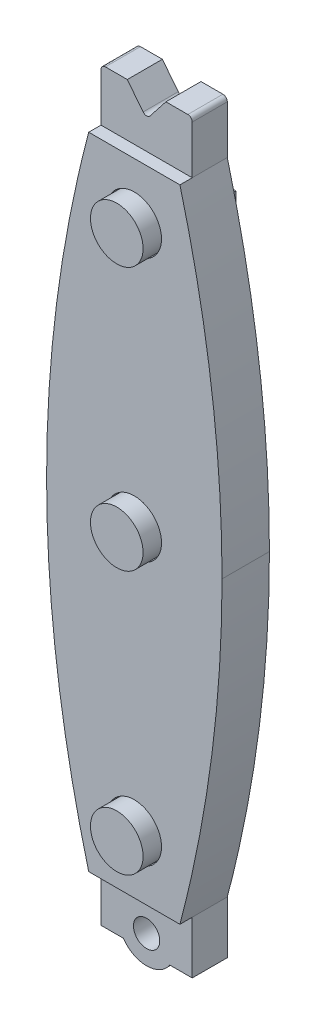
ISO-10303-21;
HEADER;
FILE_DESCRIPTION(('STEP AP214'),'2;1');
FILE_NAME('part.step','',(''),(''),'','','');
FILE_SCHEMA(('AUTOMOTIVE_DESIGN { 1 0 10303 214 1 1 1 1 }'));
ENDSEC;
DATA;
#1=APPLICATION_CONTEXT('core data for automotive mechanical design processes');
#2=APPLICATION_PROTOCOL_DEFINITION('international standard','automotive_design',2000,#1);
#3=PRODUCT_CONTEXT('',#1,'mechanical');
#4=PRODUCT('Part','Part','',(#3));
#5=PRODUCT_RELATED_PRODUCT_CATEGORY('part','',(#4));
#6=PRODUCT_DEFINITION_FORMATION('','',#4);
#7=PRODUCT_DEFINITION_CONTEXT('part definition',#1,'design');
#8=PRODUCT_DEFINITION('design','',#6,#7);
#9=PRODUCT_DEFINITION_SHAPE('','',#8);
#10=(LENGTH_UNIT() NAMED_UNIT(*) SI_UNIT(.MILLI.,.METRE.));
#11=(NAMED_UNIT(*) PLANE_ANGLE_UNIT() SI_UNIT($,.RADIAN.));
#12=(NAMED_UNIT(*) SI_UNIT($,.STERADIAN.) SOLID_ANGLE_UNIT());
#13=UNCERTAINTY_MEASURE_WITH_UNIT(LENGTH_MEASURE(1.E-05),#10,'distance_accuracy_value','');
#14=(GEOMETRIC_REPRESENTATION_CONTEXT(3) GLOBAL_UNCERTAINTY_ASSIGNED_CONTEXT((#13)) GLOBAL_UNIT_ASSIGNED_CONTEXT((#10,
#11,#12)) REPRESENTATION_CONTEXT('',''));
#15=CARTESIAN_POINT('',(0.,0.,0.));
#16=DIRECTION('',(0.,0.,1.));
#17=DIRECTION('',(1.,0.,0.));
#18=AXIS2_PLACEMENT_3D('',#15,#16,#17);
#19=CARTESIAN_POINT('',(0.,0.,0.));
#20=DIRECTION('',(0.,0.,1.));
#21=DIRECTION('',(1.,0.,0.));
#22=AXIS2_PLACEMENT_3D('',#19,#20,#21);
#23=PLANE('',#22);
#24=DIRECTION('',(0.,1.,0.));
#25=VECTOR('',#24,1.);
#26=CARTESIAN_POINT('',(-26.9659834710744,-62.6986404958678,0.));
#27=LINE('',#26,#25);
#28=CARTESIAN_POINT('',(-26.9659834710744,-58.3806404958678,0.));
#29=VERTEX_POINT('',#28);
#30=CARTESIAN_POINT('',(-26.9659834710744,-50.7606404958678,0.));
#31=VERTEX_POINT('',#30);
#32=EDGE_CURVE('E582',#29,#31,#27,.T.);
#33=ORIENTED_EDGE('',*,*,#32,.T.);
#34=CARTESIAN_POINT('',(-26.9659834710744,-50.7606404958678,0.));
#35=CARTESIAN_POINT('',(-33.0619834710744,-27.5831404958678,0.));
#36=CARTESIAN_POINT('',(-33.0619834710744,-4.40564049586777,0.));
#37=B_SPLINE_CURVE_WITH_KNOTS('',2,(#34,#35,#36),.UNSPECIFIED.,.F.,.F.,(3,3),(0.5,1.),.UNSPECIFIED.);
#38=CARTESIAN_POINT('',(-33.0619834710744,-4.40564049586777,0.));
#39=VERTEX_POINT('',#38);
#40=EDGE_CURVE('E222',#31,#39,#37,.T.);
#41=ORIENTED_EDGE('',*,*,#40,.T.);
#42=CARTESIAN_POINT('',(-33.0619834710744,-4.40564049586779,0.));
#43=CARTESIAN_POINT('',(-33.0619834710744,18.7718595041322,0.));
#44=CARTESIAN_POINT('',(-26.9659834710744,41.9493595041322,0.));
#45=B_SPLINE_CURVE_WITH_KNOTS('',2,(#42,#43,#44),.UNSPECIFIED.,.F.,.F.,(3,3),(0.,0.5),.UNSPECIFIED.);
#46=CARTESIAN_POINT('',(-26.9659834710744,41.9493595041322,0.));
#47=VERTEX_POINT('',#46);
#48=EDGE_CURVE('E294',#39,#47,#45,.T.);
#49=ORIENTED_EDGE('',*,*,#48,.T.);
#50=DIRECTION('',(0.,-1.,0.));
#51=VECTOR('',#50,1.);
#52=CARTESIAN_POINT('',(-26.9659834710744,49.5693595041322,0.));
#53=LINE('',#52,#51);
#54=CARTESIAN_POINT('',(-26.9659834710744,48.9343595041322,0.));
#55=VERTEX_POINT('',#54);
#56=EDGE_CURVE('E485',#55,#47,#53,.T.);
#57=ORIENTED_EDGE('',*,*,#56,.F.);
#58=CARTESIAN_POINT('',(-26.3309834710744,48.9343595041322,0.));
#59=DIRECTION('',(0.,0.,1.));
#60=DIRECTION('',(1.,0.,0.));
#61=AXIS2_PLACEMENT_3D('',#58,#59,#60);
#62=CIRCLE('',#61,0.635);
#63=CARTESIAN_POINT('',(-26.3309834710744,49.5693595041322,0.));
#64=VERTEX_POINT('',#63);
#65=EDGE_CURVE('E597',#55,#64,#62,.F.);
#66=ORIENTED_EDGE('',*,*,#65,.T.);
#67=DIRECTION('',(-1.,0.,0.));
#68=VECTOR('',#67,1.);
#69=CARTESIAN_POINT('',(-13.7579834710744,49.5693595041322,0.));
#70=LINE('',#69,#68);
#71=CARTESIAN_POINT('',(-23.1559834710744,49.5693595041322,0.));
#72=VERTEX_POINT('',#71);
#73=EDGE_CURVE('E481',#72,#64,#70,.T.);
#74=ORIENTED_EDGE('',*,*,#73,.F.);
#75=DIRECTION('',(0.617821551931903,-0.786318338822423,0.));
#76=VECTOR('',#75,1.);
#77=CARTESIAN_POINT('',(-23.1559834710744,49.5693595041322,0.));
#78=LINE('',#77,#76);
#79=CARTESIAN_POINT('',(-20.8612956162266,46.6488476888714,0.));
#80=VERTEX_POINT('',#79);
#81=EDGE_CURVE('E460',#72,#80,#78,.T.);
#82=ORIENTED_EDGE('',*,*,#81,.T.);
#83=CARTESIAN_POINT('',(-20.3619834710744,47.0411643743482,0.));
#84=DIRECTION('',(0.,0.,1.));
#85=DIRECTION('',(1.,0.,0.));
#86=AXIS2_PLACEMENT_3D('',#83,#84,#85);
#87=CIRCLE('',#86,0.635);
#88=CARTESIAN_POINT('',(-19.8626713259222,46.6488476888714,0.));
#89=VERTEX_POINT('',#88);
#90=EDGE_CURVE('E11',#80,#89,#87,.T.);
#91=ORIENTED_EDGE('',*,*,#90,.T.);
#92=DIRECTION('',(0.617821551931903,0.786318338822423,0.));
#93=VECTOR('',#92,1.);
#94=CARTESIAN_POINT('',(-20.3619834710744,46.0133595041322,0.));
#95=LINE('',#94,#93);
#96=CARTESIAN_POINT('',(-17.5679834710744,49.5693595041322,0.));
#97=VERTEX_POINT('',#96);
#98=EDGE_CURVE('E457',#89,#97,#95,.T.);
#99=ORIENTED_EDGE('',*,*,#98,.T.);
#100=CARTESIAN_POINT('',(-14.3929834710744,49.5693595041322,0.));
#101=VERTEX_POINT('',#100);
#102=EDGE_CURVE('E483',#101,#97,#70,.T.);
#103=ORIENTED_EDGE('',*,*,#102,.F.);
#104=CARTESIAN_POINT('',(-14.3929834710744,48.9343595041322,0.));
#105=DIRECTION('',(0.,0.,1.));
#106=DIRECTION('',(1.,0.,0.));
#107=AXIS2_PLACEMENT_3D('',#104,#105,#106);
#108=CIRCLE('',#107,0.635);
#109=CARTESIAN_POINT('',(-13.7579834710744,48.9343595041322,0.));
#110=VERTEX_POINT('',#109);
#111=EDGE_CURVE('E595',#101,#110,#108,.F.);
#112=ORIENTED_EDGE('',*,*,#111,.T.);
#113=DIRECTION('',(0.,-1.,0.));
#114=VECTOR('',#113,1.);
#115=CARTESIAN_POINT('',(-13.7579834710744,49.5693595041322,0.));
#116=LINE('',#115,#114);
#117=CARTESIAN_POINT('',(-13.7579834710744,41.9493595041322,0.));
#118=VERTEX_POINT('',#117);
#119=EDGE_CURVE('E496',#110,#118,#116,.T.);
#120=ORIENTED_EDGE('',*,*,#119,.T.);
#121=CARTESIAN_POINT('',(-13.7579834710744,41.9493595041322,0.));
#122=CARTESIAN_POINT('',(-7.6619834710744,18.7718595041322,0.));
#123=CARTESIAN_POINT('',(-7.6619834710744,-4.40564049586779,0.));
#124=B_SPLINE_CURVE_WITH_KNOTS('',2,(#121,#122,#123),.UNSPECIFIED.,.F.,.F.,(3,3),(0.,0.5),.UNSPECIFIED.);
#125=CARTESIAN_POINT('',(-7.6619834710744,-4.4056404958678,0.));
#126=VERTEX_POINT('',#125);
#127=EDGE_CURVE('E475',#118,#126,#124,.T.);
#128=ORIENTED_EDGE('',*,*,#127,.T.);
#129=CARTESIAN_POINT('',(-7.6619834710744,-4.4056404958678,0.));
#130=CARTESIAN_POINT('',(-7.66198347107439,-27.5831404958678,0.));
#131=CARTESIAN_POINT('',(-13.7579834710744,-50.7606404958678,0.));
#132=B_SPLINE_CURVE_WITH_KNOTS('',2,(#129,#130,#131),.UNSPECIFIED.,.F.,.F.,(3,3),(0.,
0.500000000000001),.UNSPECIFIED.);
#133=CARTESIAN_POINT('',(-13.7579834710744,-50.7606404958678,0.));
#134=VERTEX_POINT('',#133);
#135=EDGE_CURVE('E254',#126,#134,#132,.T.);
#136=ORIENTED_EDGE('',*,*,#135,.T.);
#137=DIRECTION('',(0.,1.,0.));
#138=VECTOR('',#137,1.);
#139=CARTESIAN_POINT('',(-13.7579834710744,-62.6986404958678,0.));
#140=LINE('',#139,#138);
#141=CARTESIAN_POINT('',(-13.7579834710744,-58.3806404958678,0.));
#142=VERTEX_POINT('',#141);
#143=EDGE_CURVE('E579',#142,#134,#140,.T.);
#144=ORIENTED_EDGE('',*,*,#143,.F.);
#145=DIRECTION('',(-1.,0.,0.));
#146=VECTOR('',#145,1.);
#147=CARTESIAN_POINT('',(-13.7579834710744,-58.3806404958678,0.));
#148=LINE('',#147,#146);
#149=CARTESIAN_POINT('',(-17.0018793060224,-58.3806404958678,0.));
#150=VERTEX_POINT('',#149);
#151=EDGE_CURVE('E560',#142,#150,#148,.T.);
#152=ORIENTED_EDGE('',*,*,#151,.T.);
#153=CARTESIAN_POINT('',(-20.3619834710744,-56.0946404958678,0.));
#154=DIRECTION('',(0.,0.,-1.));
#155=DIRECTION('',(1.,0.,0.));
#156=AXIS2_PLACEMENT_3D('',#153,#154,#155);
#157=CIRCLE('',#156,4.064);
#158=CARTESIAN_POINT('',(-23.7220876361264,-58.3806404958678,0.));
#159=VERTEX_POINT('',#158);
#160=EDGE_CURVE('E553',#150,#159,#157,.T.);
#161=ORIENTED_EDGE('',*,*,#160,.T.);
#162=DIRECTION('',(-1.,0.,0.));
#163=VECTOR('',#162,1.);
#164=CARTESIAN_POINT('',(-23.7220876361264,-58.3806404958678,0.));
#165=LINE('',#164,#163);
#166=EDGE_CURVE('E556',#159,#29,#165,.T.);
#167=ORIENTED_EDGE('',*,*,#166,.T.);
#168=EDGE_LOOP('',(#33,#41,#49,#57,#66,#74,#82,#91,#99,#103,#112,#120,#128,#136,#144,#152,#161,#167));
#169=FACE_BOUND('',#168,.T.);
#170=CARTESIAN_POINT('',(-20.3619834710744,-56.0946404958678,0.));
#171=DIRECTION('',(0.,0.,1.));
#172=DIRECTION('',(1.,0.,0.));
#173=AXIS2_PLACEMENT_3D('',#170,#171,#172);
#174=CIRCLE('',#173,1.905);
#175=CARTESIAN_POINT('',(-18.4569834710744,-56.0946404958678,0.));
#176=VERTEX_POINT('',#175);
#177=EDGE_CURVE('E547',#176,#176,#174,.T.);
#178=ORIENTED_EDGE('',*,*,#177,.T.);
#179=EDGE_LOOP('',(#178));
#180=FACE_BOUND('',#179,.T.);
#181=DIRECTION('',(0.,1.,0.));
#182=VECTOR('',#181,1.);
#183=CARTESIAN_POINT('',(-26.7119834710744,-45.6806404958678,0.));
#184=LINE('',#183,#182);
#185=CARTESIAN_POINT('',(-26.7119834710744,-45.6806404958678,0.));
#186=VERTEX_POINT('',#185);
#187=CARTESIAN_POINT('',(-26.7119834710744,36.8693595041322,0.));
#188=VERTEX_POINT('',#187);
#189=EDGE_CURVE('E219',#186,#188,#184,.T.);
#190=ORIENTED_EDGE('',*,*,#189,.F.);
#191=DIRECTION('',(-1.,0.,0.));
#192=VECTOR('',#191,1.);
#193=CARTESIAN_POINT('',(-14.0119834710744,-45.6806404958678,0.));
#194=LINE('',#193,#192);
#195=CARTESIAN_POINT('',(-14.0119834710744,-45.6806404958678,0.));
#196=VERTEX_POINT('',#195);
#197=EDGE_CURVE('E216',#196,#186,#194,.T.);
#198=ORIENTED_EDGE('',*,*,#197,.F.);
#199=DIRECTION('',(0.,-1.,0.));
#200=VECTOR('',#199,1.);
#201=CARTESIAN_POINT('',(-14.0119834710744,-45.6806404958678,0.));
#202=LINE('',#201,#200);
#203=CARTESIAN_POINT('',(-14.0119834710744,36.8693595041322,0.));
#204=VERTEX_POINT('',#203);
#205=EDGE_CURVE('E59',#204,#196,#202,.T.);
#206=ORIENTED_EDGE('',*,*,#205,.F.);
#207=DIRECTION('',(1.,0.,0.));
#208=VECTOR('',#207,1.);
#209=CARTESIAN_POINT('',(-14.0119834710744,36.8693595041322,0.));
#210=LINE('',#209,#208);
#211=EDGE_CURVE('E54',#188,#204,#210,.T.);
#212=ORIENTED_EDGE('',*,*,#211,.F.);
#213=EDGE_LOOP('',(#190,#198,#206,#212));
#214=FACE_BOUND('',#213,.T.);
#215=ADVANCED_FACE('F37',(#169,#180,#214),#23,.F.);
#216=CARTESIAN_POINT('',(0.,49.5693595041322,0.));
#217=DIRECTION('',(0.,1.,0.));
#218=DIRECTION('',(0.,0.,1.));
#219=AXIS2_PLACEMENT_3D('',#216,#217,#218);
#220=PLANE('',#219);
#221=DIRECTION('',(1.,0.,0.));
#222=VECTOR('',#221,1.);
#223=CARTESIAN_POINT('',(-13.7579834710744,49.5693595041322,5.08));
#224=LINE('',#223,#222);
#225=CARTESIAN_POINT('',(-17.5679834710744,49.5693595041322,5.08));
#226=VERTEX_POINT('',#225);
#227=CARTESIAN_POINT('',(-14.3929834710744,49.5693595041322,5.08));
#228=VERTEX_POINT('',#227);
#229=EDGE_CURVE('E482',#226,#228,#224,.T.);
#230=ORIENTED_EDGE('',*,*,#229,.T.);
#231=DIRECTION('',(0.,0.,-1.));
#232=VECTOR('',#231,1.);
#233=CARTESIAN_POINT('',(-14.3929834710744,49.5693595041322,0.));
#234=LINE('',#233,#232);
#235=EDGE_CURVE('E601',#228,#101,#234,.T.);
#236=ORIENTED_EDGE('',*,*,#235,.T.);
#237=ORIENTED_EDGE('',*,*,#102,.T.);
#238=DIRECTION('',(0.,0.,1.));
#239=VECTOR('',#238,1.);
#240=CARTESIAN_POINT('',(-17.5679834710744,49.5693595041322,0.));
#241=LINE('',#240,#239);
#242=EDGE_CURVE('E463',#97,#226,#241,.T.);
#243=ORIENTED_EDGE('',*,*,#242,.T.);
#244=EDGE_LOOP('',(#230,#236,#237,#243));
#245=FACE_BOUND('',#244,.T.);
#246=ADVANCED_FACE('F333',(#245),#220,.T.);
#247=CARTESIAN_POINT('',(-33.0619834710744,41.9493595041322,5.08));
#248=DIRECTION('',(0.,-1.,0.));
#249=DIRECTION('',(0.,0.,-1.));
#250=AXIS2_PLACEMENT_3D('',#247,#248,#249);
#251=PLANE('',#250);
#252=DIRECTION('',(1.,0.,0.));
#253=VECTOR('',#252,1.);
#254=CARTESIAN_POINT('',(-13.7579834710744,41.9493595041322,5.08));
#255=LINE('',#254,#253);
#256=CARTESIAN_POINT('',(-26.9659834710744,41.9493595041322,5.08));
#257=VERTEX_POINT('',#256);
#258=CARTESIAN_POINT('',(-13.7579834710744,41.9493595041322,5.08));
#259=VERTEX_POINT('',#258);
#260=EDGE_CURVE('E488',#257,#259,#255,.T.);
#261=ORIENTED_EDGE('',*,*,#260,.F.);
#262=DIRECTION('',(0.,0.,1.));
#263=VECTOR('',#262,1.);
#264=CARTESIAN_POINT('',(-26.9659834710744,41.9493595041322,-0.761999999999999));
#265=LINE('',#264,#263);
#266=CARTESIAN_POINT('',(-26.9659834710744,41.9493595041322,6.858));
#267=VERTEX_POINT('',#266);
#268=EDGE_CURVE('E287',#257,#267,#265,.T.);
#269=ORIENTED_EDGE('',*,*,#268,.T.);
#270=DIRECTION('',(-1.,0.,0.));
#271=VECTOR('',#270,1.);
#272=CARTESIAN_POINT('',(-7.6619834710744,41.9493595041322,6.858));
#273=LINE('',#272,#271);
#274=CARTESIAN_POINT('',(-13.7579834710744,41.9493595041322,6.858));
#275=VERTEX_POINT('',#274);
#276=EDGE_CURVE('E539',#275,#267,#273,.T.);
#277=ORIENTED_EDGE('',*,*,#276,.F.);
#278=DIRECTION('',(0.,0.,1.));
#279=VECTOR('',#278,1.);
#280=CARTESIAN_POINT('',(-13.7579834710744,41.9493595041322,-0.761999999999999));
#281=LINE('',#280,#279);
#282=EDGE_CURVE('E645',#259,#275,#281,.T.);
#283=ORIENTED_EDGE('',*,*,#282,.F.);
#284=EDGE_LOOP('',(#261,#269,#277,#283));
#285=FACE_BOUND('',#284,.T.);
#286=ADVANCED_FACE('F429',(#285),#251,.F.);
#287=CARTESIAN_POINT('',(-33.0619834710744,-50.7606404958678,5.08));
#288=DIRECTION('',(0.,1.,0.));
#289=DIRECTION('',(0.,0.,1.));
#290=AXIS2_PLACEMENT_3D('',#287,#288,#289);
#291=PLANE('',#290);
#292=DIRECTION('',(1.,0.,0.));
#293=VECTOR('',#292,1.);
#294=CARTESIAN_POINT('',(-7.6619834710744,-50.7606404958678,6.858));
#295=LINE('',#294,#293);
#296=CARTESIAN_POINT('',(-26.9659834710744,-50.7606404958678,6.858));
#297=VERTEX_POINT('',#296);
#298=CARTESIAN_POINT('',(-13.7579834710744,-50.7606404958678,6.858));
#299=VERTEX_POINT('',#298);
#300=EDGE_CURVE('E544',#297,#299,#295,.T.);
#301=ORIENTED_EDGE('',*,*,#300,.F.);
#302=DIRECTION('',(0.,0.,1.));
#303=VECTOR('',#302,1.);
#304=CARTESIAN_POINT('',(-26.9659834710744,-50.7606404958678,0.));
#305=LINE('',#304,#303);
#306=CARTESIAN_POINT('',(-26.9659834710744,-50.7606404958678,5.08));
#307=VERTEX_POINT('',#306);
#308=EDGE_CURVE('E232',#307,#297,#305,.T.);
#309=ORIENTED_EDGE('',*,*,#308,.F.);
#310=DIRECTION('',(1.,0.,0.));
#311=VECTOR('',#310,1.);
#312=CARTESIAN_POINT('',(-7.6619834710744,-50.7606404958678,5.08));
#313=LINE('',#312,#311);
#314=CARTESIAN_POINT('',(-13.7579834710744,-50.7606404958678,5.08));
#315=VERTEX_POINT('',#314);
#316=EDGE_CURVE('E585',#307,#315,#313,.T.);
#317=ORIENTED_EDGE('',*,*,#316,.T.);
#318=DIRECTION('',(0.,0.,1.));
#319=VECTOR('',#318,1.);
#320=CARTESIAN_POINT('',(-13.7579834710744,-50.7606404958678,0.));
#321=LINE('',#320,#319);
#322=EDGE_CURVE('E261',#315,#299,#321,.T.);
#323=ORIENTED_EDGE('',*,*,#322,.T.);
#324=EDGE_LOOP('',(#301,#309,#317,#323));
#325=FACE_BOUND('',#324,.T.);
#326=ADVANCED_FACE('F424',(#325),#291,.F.);
#327=CARTESIAN_POINT('',(0.,0.,5.08));
#328=DIRECTION('',(0.,0.,1.));
#329=DIRECTION('',(1.,0.,0.));
#330=AXIS2_PLACEMENT_3D('',#327,#328,#329);
#331=PLANE('',#330);
#332=ORIENTED_EDGE('',*,*,#316,.F.);
#333=DIRECTION('',(0.,1.,0.));
#334=VECTOR('',#333,1.);
#335=CARTESIAN_POINT('',(-26.9659834710744,-62.6986404958678,5.08));
#336=LINE('',#335,#334);
#337=CARTESIAN_POINT('',(-26.9659834710744,-58.3806404958678,5.08));
#338=VERTEX_POINT('',#337);
#339=EDGE_CURVE('E609',#338,#307,#336,.T.);
#340=ORIENTED_EDGE('',*,*,#339,.F.);
#341=DIRECTION('',(-1.,0.,0.));
#342=VECTOR('',#341,1.);
#343=CARTESIAN_POINT('',(-23.7220876361264,-58.3806404958678,5.08));
#344=LINE('',#343,#342);
#345=CARTESIAN_POINT('',(-23.7220876361264,-58.3806404958678,5.08));
#346=VERTEX_POINT('',#345);
#347=EDGE_CURVE('E566',#346,#338,#344,.T.);
#348=ORIENTED_EDGE('',*,*,#347,.F.);
#349=CARTESIAN_POINT('',(-20.3619834710744,-56.0946404958678,5.08));
#350=DIRECTION('',(0.,0.,-1.));
#351=DIRECTION('',(1.,0.,0.));
#352=AXIS2_PLACEMENT_3D('',#349,#350,#351);
#353=CIRCLE('',#352,4.064);
#354=CARTESIAN_POINT('',(-17.0018793060224,-58.3806404958678,5.08));
#355=VERTEX_POINT('',#354);
#356=EDGE_CURVE('E550',#355,#346,#353,.T.);
#357=ORIENTED_EDGE('',*,*,#356,.F.);
#358=DIRECTION('',(-1.,0.,0.));
#359=VECTOR('',#358,1.);
#360=CARTESIAN_POINT('',(-13.7579834710744,-58.3806404958678,5.08));
#361=LINE('',#360,#359);
#362=CARTESIAN_POINT('',(-13.7579834710744,-58.3806404958678,5.08));
#363=VERTEX_POINT('',#362);
#364=EDGE_CURVE('E557',#363,#355,#361,.T.);
#365=ORIENTED_EDGE('',*,*,#364,.F.);
#366=DIRECTION('',(0.,1.,0.));
#367=VECTOR('',#366,1.);
#368=CARTESIAN_POINT('',(-13.7579834710744,-62.6986404958678,5.08));
#369=LINE('',#368,#367);
#370=EDGE_CURVE('E583',#363,#315,#369,.T.);
#371=ORIENTED_EDGE('',*,*,#370,.T.);
#372=EDGE_LOOP('',(#332,#340,#348,#357,#365,#371));
#373=FACE_BOUND('',#372,.T.);
#374=CARTESIAN_POINT('',(-20.3619834710744,-56.0946404958678,5.08));
#375=DIRECTION('',(0.,0.,1.));
#376=DIRECTION('',(1.,0.,0.));
#377=AXIS2_PLACEMENT_3D('',#374,#375,#376);
#378=CIRCLE('',#377,1.905);
#379=CARTESIAN_POINT('',(-18.4569834710744,-56.0946404958678,5.08));
#380=VERTEX_POINT('',#379);
#381=EDGE_CURVE('E546',#380,#380,#378,.T.);
#382=ORIENTED_EDGE('',*,*,#381,.F.);
#383=EDGE_LOOP('',(#382));
#384=FACE_BOUND('',#383,.T.);
#385=ADVANCED_FACE('F420',(#373,#384),#331,.T.);
#386=CARTESIAN_POINT('',(-26.9659834710744,-62.6986404958678,5.08));
#387=DIRECTION('',(1.,0.,0.));
#388=DIRECTION('',(0.,0.,-1.));
#389=AXIS2_PLACEMENT_3D('',#386,#387,#388);
#390=PLANE('',#389);
#391=ORIENTED_EDGE('',*,*,#32,.F.);
#392=DIRECTION('',(0.,0.,1.));
#393=VECTOR('',#392,1.);
#394=CARTESIAN_POINT('',(-26.9659834710744,-58.3806404958678,0.));
#395=LINE('',#394,#393);
#396=EDGE_CURVE('E575',#29,#338,#395,.T.);
#397=ORIENTED_EDGE('',*,*,#396,.T.);
#398=ORIENTED_EDGE('',*,*,#339,.T.);
#399=DIRECTION('',(0.,0.,-1.));
#400=VECTOR('',#399,1.);
#401=CARTESIAN_POINT('',(-26.9659834710744,-50.7606404958678,5.08));
#402=LINE('',#401,#400);
#403=EDGE_CURVE('E572',#307,#31,#402,.T.);
#404=ORIENTED_EDGE('',*,*,#403,.T.);
#405=EDGE_LOOP('',(#391,#397,#398,#404));
#406=FACE_BOUND('',#405,.T.);
#407=ADVANCED_FACE('F416',(#406),#390,.F.);
#408=CARTESIAN_POINT('',(-13.7579834710744,-62.6986404958678,5.08));
#409=DIRECTION('',(-1.,0.,0.));
#410=DIRECTION('',(0.,0.,1.));
#411=AXIS2_PLACEMENT_3D('',#408,#409,#410);
#412=PLANE('',#411);
#413=ORIENTED_EDGE('',*,*,#370,.F.);
#414=DIRECTION('',(0.,0.,1.));
#415=VECTOR('',#414,1.);
#416=CARTESIAN_POINT('',(-13.7579834710744,-58.3806404958678,0.));
#417=LINE('',#416,#415);
#418=EDGE_CURVE('E573',#142,#363,#417,.T.);
#419=ORIENTED_EDGE('',*,*,#418,.F.);
#420=ORIENTED_EDGE('',*,*,#143,.T.);
#421=DIRECTION('',(0.,0.,1.));
#422=VECTOR('',#421,1.);
#423=CARTESIAN_POINT('',(-13.7579834710744,-50.7606404958678,5.08));
#424=LINE('',#423,#422);
#425=EDGE_CURVE('E612',#134,#315,#424,.T.);
#426=ORIENTED_EDGE('',*,*,#425,.T.);
#427=EDGE_LOOP('',(#413,#419,#420,#426));
#428=FACE_BOUND('',#427,.T.);
#429=ADVANCED_FACE('F412',(#428),#412,.F.);
#430=CARTESIAN_POINT('',(-20.3619834710744,-56.0946404958678,0.));
#431=DIRECTION('',(0.,0.,1.));
#432=DIRECTION('',(1.,0.,0.));
#433=AXIS2_PLACEMENT_3D('',#430,#431,#432);
#434=CYLINDRICAL_SURFACE('',#433,4.064);
#435=ORIENTED_EDGE('',*,*,#356,.T.);
#436=DIRECTION('',(0.,0.,1.));
#437=VECTOR('',#436,1.);
#438=CARTESIAN_POINT('',(-23.7220876361264,-58.3806404958678,0.));
#439=LINE('',#438,#437);
#440=EDGE_CURVE('E563',#159,#346,#439,.T.);
#441=ORIENTED_EDGE('',*,*,#440,.F.);
#442=ORIENTED_EDGE('',*,*,#160,.F.);
#443=DIRECTION('',(0.,0.,1.));
#444=VECTOR('',#443,1.);
#445=CARTESIAN_POINT('',(-17.0018793060224,-58.3806404958678,0.));
#446=LINE('',#445,#444);
#447=EDGE_CURVE('E570',#150,#355,#446,.T.);
#448=ORIENTED_EDGE('',*,*,#447,.T.);
#449=EDGE_LOOP('',(#435,#441,#442,#448));
#450=FACE_BOUND('',#449,.T.);
#451=ADVANCED_FACE('F405',(#450),#434,.T.);
#452=CARTESIAN_POINT('',(-13.7579834710744,-58.3806404958678,0.));
#453=DIRECTION('',(0.,1.,0.));
#454=DIRECTION('',(0.,0.,1.));
#455=AXIS2_PLACEMENT_3D('',#452,#453,#454);
#456=PLANE('',#455);
#457=ORIENTED_EDGE('',*,*,#364,.T.);
#458=ORIENTED_EDGE('',*,*,#447,.F.);
#459=ORIENTED_EDGE('',*,*,#151,.F.);
#460=ORIENTED_EDGE('',*,*,#418,.T.);
#461=EDGE_LOOP('',(#457,#458,#459,#460));
#462=FACE_BOUND('',#461,.T.);
#463=ADVANCED_FACE('F402',(#462),#456,.F.);
#464=CARTESIAN_POINT('',(-23.7220876361264,-58.3806404958678,0.));
#465=DIRECTION('',(0.,1.,0.));
#466=DIRECTION('',(0.,0.,1.));
#467=AXIS2_PLACEMENT_3D('',#464,#465,#466);
#468=PLANE('',#467);
#469=ORIENTED_EDGE('',*,*,#347,.T.);
#470=ORIENTED_EDGE('',*,*,#396,.F.);
#471=ORIENTED_EDGE('',*,*,#166,.F.);
#472=ORIENTED_EDGE('',*,*,#440,.T.);
#473=EDGE_LOOP('',(#469,#470,#471,#472));
#474=FACE_BOUND('',#473,.T.);
#475=ADVANCED_FACE('F400',(#474),#468,.F.);
#476=CARTESIAN_POINT('',(-20.3619834710744,-56.0946404958678,0.));
#477=DIRECTION('',(0.,0.,1.));
#478=DIRECTION('',(1.,0.,0.));
#479=AXIS2_PLACEMENT_3D('',#476,#477,#478);
#480=CYLINDRICAL_SURFACE('',#479,1.905);
#481=ORIENTED_EDGE('',*,*,#177,.F.);
#482=EDGE_LOOP('',(#481));
#483=FACE_BOUND('',#482,.T.);
#484=ORIENTED_EDGE('',*,*,#381,.T.);
#485=EDGE_LOOP('',(#484));
#486=FACE_BOUND('',#485,.T.);
#487=ADVANCED_FACE('F396',(#483,#486),#480,.F.);
#488=CARTESIAN_POINT('',(0.,0.,6.858));
#489=DIRECTION('',(0.,0.,1.));
#490=DIRECTION('',(1.,0.,0.));
#491=AXIS2_PLACEMENT_3D('',#488,#489,#490);
#492=PLANE('',#491);
#493=CARTESIAN_POINT('',(-26.9659834710744,-50.7606404958678,6.858));
#494=CARTESIAN_POINT('',(-33.0619834710744,-27.5831404958678,6.858));
#495=CARTESIAN_POINT('',(-33.0619834710744,-4.40564049586777,6.858));
#496=B_SPLINE_CURVE_WITH_KNOTS('',2,(#493,#494,#495),.UNSPECIFIED.,.F.,.F.,(3,3),(0.5,1.),.UNSPECIFIED.);
#497=CARTESIAN_POINT('',(-33.0619834710744,-4.40564049586777,6.858));
#498=VERTEX_POINT('',#497);
#499=EDGE_CURVE('E220',#297,#498,#496,.T.);
#500=ORIENTED_EDGE('',*,*,#499,.F.);
#501=ORIENTED_EDGE('',*,*,#300,.T.);
#502=CARTESIAN_POINT('',(-7.6619834710744,-4.4056404958678,6.858));
#503=CARTESIAN_POINT('',(-7.66198347107439,-27.5831404958678,6.858));
#504=CARTESIAN_POINT('',(-13.7579834710744,-50.7606404958678,6.858));
#505=B_SPLINE_CURVE_WITH_KNOTS('',2,(#502,#503,#504),.UNSPECIFIED.,.F.,.F.,(3,3),(0.,
0.500000000000001),.UNSPECIFIED.);
#506=CARTESIAN_POINT('',(-7.6619834710744,-4.4056404958678,6.858));
#507=VERTEX_POINT('',#506);
#508=EDGE_CURVE('E262',#507,#299,#505,.T.);
#509=ORIENTED_EDGE('',*,*,#508,.F.);
#510=CARTESIAN_POINT('',(-13.7579834710744,41.9493595041322,6.858));
#511=CARTESIAN_POINT('',(-7.6619834710744,18.7718595041322,6.858));
#512=CARTESIAN_POINT('',(-7.6619834710744,-4.40564049586779,6.858));
#513=B_SPLINE_CURVE_WITH_KNOTS('',2,(#510,#511,#512),.UNSPECIFIED.,.F.,.F.,(3,3),(0.,0.5),.UNSPECIFIED.);
#514=EDGE_CURVE('E301',#275,#507,#513,.T.);
#515=ORIENTED_EDGE('',*,*,#514,.F.);
#516=ORIENTED_EDGE('',*,*,#276,.T.);
#517=CARTESIAN_POINT('',(-33.0619834710744,-4.40564049586779,6.858));
#518=CARTESIAN_POINT('',(-33.0619834710744,18.7718595041322,6.858));
#519=CARTESIAN_POINT('',(-26.9659834710744,41.9493595041322,6.858));
#520=B_SPLINE_CURVE_WITH_KNOTS('',2,(#517,#518,#519),.UNSPECIFIED.,.F.,.F.,(3,3),(0.,0.5),.UNSPECIFIED.);
#521=EDGE_CURVE('E276',#498,#267,#520,.T.);
#522=ORIENTED_EDGE('',*,*,#521,.F.);
#523=EDGE_LOOP('',(#500,#501,#509,#515,#516,#522));
#524=FACE_BOUND('',#523,.T.);
#525=CARTESIAN_POINT('',(-20.3619834710744,-4.27864049586779,6.858));
#526=DIRECTION('',(0.,0.,1.));
#527=DIRECTION('',(1.,0.,0.));
#528=AXIS2_PLACEMENT_3D('',#525,#526,#527);
#529=CIRCLE('',#528,3.937);
#530=CARTESIAN_POINT('',(-16.4249834710744,-4.27864049586779,6.858));
#531=VERTEX_POINT('',#530);
#532=EDGE_CURVE('E528',#531,#531,#529,.T.);
#533=ORIENTED_EDGE('',*,*,#532,.F.);
#534=EDGE_LOOP('',(#533));
#535=FACE_BOUND('',#534,.T.);
#536=CARTESIAN_POINT('',(-20.3619834710744,33.8213595041322,6.858));
#537=DIRECTION('',(0.,0.,1.));
#538=DIRECTION('',(1.,0.,0.));
#539=AXIS2_PLACEMENT_3D('',#536,#537,#538);
#540=CIRCLE('',#539,3.937);
#541=CARTESIAN_POINT('',(-16.4249834710744,33.8213595041322,6.858));
#542=VERTEX_POINT('',#541);
#543=EDGE_CURVE('E521',#542,#542,#540,.T.);
#544=ORIENTED_EDGE('',*,*,#543,.F.);
#545=EDGE_LOOP('',(#544));
#546=FACE_BOUND('',#545,.T.);
#547=CARTESIAN_POINT('',(-20.3619834710744,-42.3786404958678,6.858));
#548=DIRECTION('',(0.,0.,1.));
#549=DIRECTION('',(1.,0.,0.));
#550=AXIS2_PLACEMENT_3D('',#547,#548,#549);
#551=CIRCLE('',#550,3.937);
#552=CARTESIAN_POINT('',(-16.4249834710744,-42.3786404958678,6.858));
#553=VERTEX_POINT('',#552);
#554=EDGE_CURVE('E527',#553,#553,#551,.T.);
#555=ORIENTED_EDGE('',*,*,#554,.F.);
#556=EDGE_LOOP('',(#555));
#557=FACE_BOUND('',#556,.T.);
#558=ADVANCED_FACE('F392',(#524,#535,#546,#557),#492,.T.);
#559=CARTESIAN_POINT('',(-20.3619834710744,-42.3786404958678,5.588));
#560=DIRECTION('',(0.,0.,1.));
#561=DIRECTION('',(1.,0.,0.));
#562=AXIS2_PLACEMENT_3D('',#559,#560,#561);
#563=CYLINDRICAL_SURFACE('',#562,3.937);
#564=CARTESIAN_POINT('',(-20.3619834710744,-42.3786404958678,5.588));
#565=DIRECTION('',(0.,0.,1.));
#566=DIRECTION('',(1.,0.,0.));
#567=AXIS2_PLACEMENT_3D('',#564,#565,#566);
#568=CIRCLE('',#567,3.937);
#569=CARTESIAN_POINT('',(-16.4249834710744,-42.3786404958678,5.588));
#570=VERTEX_POINT('',#569);
#571=EDGE_CURVE('E536',#570,#570,#568,.T.);
#572=ORIENTED_EDGE('',*,*,#571,.F.);
#573=EDGE_LOOP('',(#572));
#574=FACE_BOUND('',#573,.T.);
#575=ORIENTED_EDGE('',*,*,#554,.T.);
#576=EDGE_LOOP('',(#575));
#577=FACE_BOUND('',#576,.T.);
#578=ADVANCED_FACE('F388',(#574,#577),#563,.F.);
#579=CARTESIAN_POINT('',(-20.3619834710744,-42.3786404958678,5.588));
#580=DIRECTION('',(0.,0.,1.));
#581=DIRECTION('',(1.,0.,0.));
#582=AXIS2_PLACEMENT_3D('',#579,#580,#581);
#583=PLANE('',#582);
#584=CARTESIAN_POINT('',(-20.3619834710744,-42.3786404958678,5.588));
#585=DIRECTION('',(0.,0.,1.));
#586=DIRECTION('',(1.,0.,0.));
#587=AXIS2_PLACEMENT_3D('',#584,#585,#586);
#588=CIRCLE('',#587,3.81);
#589=CARTESIAN_POINT('',(-16.5519834710744,-42.3786404958678,5.588));
#590=VERTEX_POINT('',#589);
#591=EDGE_CURVE('E515',#590,#590,#588,.T.);
#592=ORIENTED_EDGE('',*,*,#591,.F.);
#593=EDGE_LOOP('',(#592));
#594=FACE_BOUND('',#593,.T.);
#595=ORIENTED_EDGE('',*,*,#571,.T.);
#596=EDGE_LOOP('',(#595));
#597=FACE_BOUND('',#596,.T.);
#598=ADVANCED_FACE('F384',(#594,#597),#583,.T.);
#599=CARTESIAN_POINT('',(-20.3619834710744,33.8213595041322,5.588));
#600=DIRECTION('',(0.,0.,1.));
#601=DIRECTION('',(1.,0.,0.));
#602=AXIS2_PLACEMENT_3D('',#599,#600,#601);
#603=CYLINDRICAL_SURFACE('',#602,3.937);
#604=CARTESIAN_POINT('',(-20.3619834710744,33.8213595041322,5.588));
#605=DIRECTION('',(0.,0.,1.));
#606=DIRECTION('',(1.,0.,0.));
#607=AXIS2_PLACEMENT_3D('',#604,#605,#606);
#608=CIRCLE('',#607,3.937);
#609=CARTESIAN_POINT('',(-16.4249834710744,33.8213595041322,5.588));
#610=VERTEX_POINT('',#609);
#611=EDGE_CURVE('E531',#610,#610,#608,.T.);
#612=ORIENTED_EDGE('',*,*,#611,.F.);
#613=EDGE_LOOP('',(#612));
#614=FACE_BOUND('',#613,.T.);
#615=ORIENTED_EDGE('',*,*,#543,.T.);
#616=EDGE_LOOP('',(#615));
#617=FACE_BOUND('',#616,.T.);
#618=ADVANCED_FACE('F380',(#614,#617),#603,.F.);
#619=CARTESIAN_POINT('',(-20.3619834710744,33.8213595041322,5.588));
#620=DIRECTION('',(0.,0.,1.));
#621=DIRECTION('',(1.,0.,0.));
#622=AXIS2_PLACEMENT_3D('',#619,#620,#621);
#623=PLANE('',#622);
#624=CARTESIAN_POINT('',(-20.3619834710744,33.8213595041322,5.588));
#625=DIRECTION('',(0.,0.,1.));
#626=DIRECTION('',(1.,0.,0.));
#627=AXIS2_PLACEMENT_3D('',#624,#625,#626);
#628=CIRCLE('',#627,3.81);
#629=CARTESIAN_POINT('',(-16.5519834710744,33.8213595041322,5.588));
#630=VERTEX_POINT('',#629);
#631=EDGE_CURVE('E505',#630,#630,#628,.T.);
#632=ORIENTED_EDGE('',*,*,#631,.F.);
#633=EDGE_LOOP('',(#632));
#634=FACE_BOUND('',#633,.T.);
#635=ORIENTED_EDGE('',*,*,#611,.T.);
#636=EDGE_LOOP('',(#635));
#637=FACE_BOUND('',#636,.T.);
#638=ADVANCED_FACE('F376',(#634,#637),#623,.T.);
#639=CARTESIAN_POINT('',(-20.3619834710744,-4.27864049586779,5.588));
#640=DIRECTION('',(0.,0.,1.));
#641=DIRECTION('',(1.,0.,0.));
#642=AXIS2_PLACEMENT_3D('',#639,#640,#641);
#643=CYLINDRICAL_SURFACE('',#642,3.937);
#644=CARTESIAN_POINT('',(-20.3619834710744,-4.27864049586779,5.588));
#645=DIRECTION('',(0.,0.,1.));
#646=DIRECTION('',(1.,0.,0.));
#647=AXIS2_PLACEMENT_3D('',#644,#645,#646);
#648=CIRCLE('',#647,3.937);
#649=CARTESIAN_POINT('',(-16.4249834710744,-4.27864049586779,5.588));
#650=VERTEX_POINT('',#649);
#651=EDGE_CURVE('E524',#650,#650,#648,.T.);
#652=ORIENTED_EDGE('',*,*,#651,.F.);
#653=EDGE_LOOP('',(#652));
#654=FACE_BOUND('',#653,.T.);
#655=ORIENTED_EDGE('',*,*,#532,.T.);
#656=EDGE_LOOP('',(#655));
#657=FACE_BOUND('',#656,.T.);
#658=ADVANCED_FACE('F372',(#654,#657),#643,.F.);
#659=CARTESIAN_POINT('',(-20.3619834710744,-4.27864049586779,5.588));
#660=DIRECTION('',(0.,0.,1.));
#661=DIRECTION('',(1.,0.,0.));
#662=AXIS2_PLACEMENT_3D('',#659,#660,#661);
#663=PLANE('',#662);
#664=CARTESIAN_POINT('',(-20.3619834710744,-4.27864049586779,5.588));
#665=DIRECTION('',(0.,0.,1.));
#666=DIRECTION('',(1.,0.,0.));
#667=AXIS2_PLACEMENT_3D('',#664,#665,#666);
#668=CIRCLE('',#667,3.81);
#669=CARTESIAN_POINT('',(-16.5519834710744,-4.27864049586779,5.588));
#670=VERTEX_POINT('',#669);
#671=EDGE_CURVE('E509',#670,#670,#668,.T.);
#672=ORIENTED_EDGE('',*,*,#671,.F.);
#673=EDGE_LOOP('',(#672));
#674=FACE_BOUND('',#673,.T.);
#675=ORIENTED_EDGE('',*,*,#651,.T.);
#676=EDGE_LOOP('',(#675));
#677=FACE_BOUND('',#676,.T.);
#678=ADVANCED_FACE('F368',(#674,#677),#663,.T.);
#679=CARTESIAN_POINT('',(-20.3619834710744,-42.3786404958678,9.398));
#680=DIRECTION('',(0.,0.,-1.));
#681=DIRECTION('',(-1.,0.,0.));
#682=AXIS2_PLACEMENT_3D('',#679,#680,#681);
#683=CYLINDRICAL_SURFACE('',#682,3.81);
#684=CARTESIAN_POINT('',(-20.3619834710744,-42.3786404958678,9.398));
#685=DIRECTION('',(0.,0.,1.));
#686=DIRECTION('',(1.,0.,0.));
#687=AXIS2_PLACEMENT_3D('',#684,#685,#686);
#688=CIRCLE('',#687,3.81);
#689=CARTESIAN_POINT('',(-16.5519834710744,-42.3786404958678,9.398));
#690=VERTEX_POINT('',#689);
#691=EDGE_CURVE('E518',#690,#690,#688,.T.);
#692=ORIENTED_EDGE('',*,*,#691,.F.);
#693=EDGE_LOOP('',(#692));
#694=FACE_BOUND('',#693,.T.);
#695=ORIENTED_EDGE('',*,*,#591,.T.);
#696=EDGE_LOOP('',(#695));
#697=FACE_BOUND('',#696,.T.);
#698=ADVANCED_FACE('F364',(#694,#697),#683,.T.);
#699=CARTESIAN_POINT('',(-20.3619834710744,-42.3786404958678,9.398));
#700=DIRECTION('',(0.,0.,1.));
#701=DIRECTION('',(1.,0.,0.));
#702=AXIS2_PLACEMENT_3D('',#699,#700,#701);
#703=PLANE('',#702);
#704=ORIENTED_EDGE('',*,*,#691,.T.);
#705=EDGE_LOOP('',(#704));
#706=FACE_BOUND('',#705,.T.);
#707=ADVANCED_FACE('F360',(#706),#703,.T.);
#708=CARTESIAN_POINT('',(-20.3619834710744,-4.27864049586779,9.398));
#709=DIRECTION('',(0.,0.,-1.));
#710=DIRECTION('',(-1.,0.,0.));
#711=AXIS2_PLACEMENT_3D('',#708,#709,#710);
#712=CYLINDRICAL_SURFACE('',#711,3.81);
#713=CARTESIAN_POINT('',(-20.3619834710744,-4.27864049586779,9.398));
#714=DIRECTION('',(0.,0.,1.));
#715=DIRECTION('',(1.,0.,0.));
#716=AXIS2_PLACEMENT_3D('',#713,#714,#715);
#717=CIRCLE('',#716,3.81);
#718=CARTESIAN_POINT('',(-16.5519834710744,-4.27864049586779,9.398));
#719=VERTEX_POINT('',#718);
#720=EDGE_CURVE('E512',#719,#719,#717,.T.);
#721=ORIENTED_EDGE('',*,*,#720,.F.);
#722=EDGE_LOOP('',(#721));
#723=FACE_BOUND('',#722,.T.);
#724=ORIENTED_EDGE('',*,*,#671,.T.);
#725=EDGE_LOOP('',(#724));
#726=FACE_BOUND('',#725,.T.);
#727=ADVANCED_FACE('F356',(#723,#726),#712,.T.);
#728=CARTESIAN_POINT('',(-20.3619834710744,-4.27864049586779,9.398));
#729=DIRECTION('',(0.,0.,1.));
#730=DIRECTION('',(1.,0.,0.));
#731=AXIS2_PLACEMENT_3D('',#728,#729,#730);
#732=PLANE('',#731);
#733=ORIENTED_EDGE('',*,*,#720,.T.);
#734=EDGE_LOOP('',(#733));
#735=FACE_BOUND('',#734,.T.);
#736=ADVANCED_FACE('F352',(#735),#732,.T.);
#737=CARTESIAN_POINT('',(-20.3619834710744,33.8213595041322,9.398));
#738=DIRECTION('',(0.,0.,-1.));
#739=DIRECTION('',(-1.,0.,0.));
#740=AXIS2_PLACEMENT_3D('',#737,#738,#739);
#741=CYLINDRICAL_SURFACE('',#740,3.81);
#742=CARTESIAN_POINT('',(-20.3619834710744,33.8213595041322,9.398));
#743=DIRECTION('',(0.,0.,1.));
#744=DIRECTION('',(1.,0.,0.));
#745=AXIS2_PLACEMENT_3D('',#742,#743,#744);
#746=CIRCLE('',#745,3.81);
#747=CARTESIAN_POINT('',(-16.5519834710744,33.8213595041322,9.398));
#748=VERTEX_POINT('',#747);
#749=EDGE_CURVE('E506',#748,#748,#746,.T.);
#750=ORIENTED_EDGE('',*,*,#749,.F.);
#751=EDGE_LOOP('',(#750));
#752=FACE_BOUND('',#751,.T.);
#753=ORIENTED_EDGE('',*,*,#631,.T.);
#754=EDGE_LOOP('',(#753));
#755=FACE_BOUND('',#754,.T.);
#756=ADVANCED_FACE('F348',(#752,#755),#741,.T.);
#757=CARTESIAN_POINT('',(-20.3619834710744,33.8213595041322,9.398));
#758=DIRECTION('',(0.,0.,1.));
#759=DIRECTION('',(1.,0.,0.));
#760=AXIS2_PLACEMENT_3D('',#757,#758,#759);
#761=PLANE('',#760);
#762=ORIENTED_EDGE('',*,*,#749,.T.);
#763=EDGE_LOOP('',(#762));
#764=FACE_BOUND('',#763,.T.);
#765=ADVANCED_FACE('F344',(#764),#761,.T.);
#766=CARTESIAN_POINT('',(-26.9659834710744,49.5693595041322,5.08));
#767=DIRECTION('',(1.,0.,0.));
#768=DIRECTION('',(0.,0.,-1.));
#769=AXIS2_PLACEMENT_3D('',#766,#767,#768);
#770=PLANE('',#769);
#771=DIRECTION('',(0.,-1.,0.));
#772=VECTOR('',#771,1.);
#773=CARTESIAN_POINT('',(-26.9659834710744,49.5693595041322,5.08));
#774=LINE('',#773,#772);
#775=CARTESIAN_POINT('',(-26.9659834710744,48.9343595041322,5.08));
#776=VERTEX_POINT('',#775);
#777=EDGE_CURVE('E502',#776,#257,#774,.T.);
#778=ORIENTED_EDGE('',*,*,#777,.F.);
#779=DIRECTION('',(0.,0.,1.));
#780=VECTOR('',#779,1.);
#781=CARTESIAN_POINT('',(-26.9659834710744,48.9343595041322,0.));
#782=LINE('',#781,#780);
#783=EDGE_CURVE('E593',#776,#55,#782,.F.);
#784=ORIENTED_EDGE('',*,*,#783,.T.);
#785=ORIENTED_EDGE('',*,*,#56,.T.);
#786=DIRECTION('',(0.,0.,1.));
#787=VECTOR('',#786,1.);
#788=CARTESIAN_POINT('',(-26.9659834710744,41.9493595041322,5.08));
#789=LINE('',#788,#787);
#790=EDGE_CURVE('E477',#47,#257,#789,.T.);
#791=ORIENTED_EDGE('',*,*,#790,.T.);
#792=EDGE_LOOP('',(#778,#784,#785,#791));
#793=FACE_BOUND('',#792,.T.);
#794=ADVANCED_FACE('F340',(#793),#770,.F.);
#795=CARTESIAN_POINT('',(-13.7579834710744,49.5693595041322,5.08));
#796=DIRECTION('',(0.,0.,-1.));
#797=DIRECTION('',(-1.,0.,0.));
#798=AXIS2_PLACEMENT_3D('',#795,#796,#797);
#799=PLANE('',#798);
#800=CARTESIAN_POINT('',(-26.3309834710744,49.5693595041322,5.08));
#801=VERTEX_POINT('',#800);
#802=CARTESIAN_POINT('',(-23.1559834710744,49.5693595041322,5.08));
#803=VERTEX_POINT('',#802);
#804=EDGE_CURVE('E479',#801,#803,#224,.T.);
#805=ORIENTED_EDGE('',*,*,#804,.F.);
#806=CARTESIAN_POINT('',(-26.3309834710744,48.9343595041322,5.08));
#807=DIRECTION('',(0.,0.,-1.));
#808=DIRECTION('',(-1.,0.,0.));
#809=AXIS2_PLACEMENT_3D('',#806,#807,#808);
#810=CIRCLE('',#809,0.635);
#811=EDGE_CURVE('E591',#801,#776,#810,.F.);
#812=ORIENTED_EDGE('',*,*,#811,.T.);
#813=ORIENTED_EDGE('',*,*,#777,.T.);
#814=ORIENTED_EDGE('',*,*,#260,.T.);
#815=DIRECTION('',(0.,-1.,0.));
#816=VECTOR('',#815,1.);
#817=CARTESIAN_POINT('',(-13.7579834710744,49.5693595041322,5.08));
#818=LINE('',#817,#816);
#819=CARTESIAN_POINT('',(-13.7579834710744,48.9343595041322,5.08));
#820=VERTEX_POINT('',#819);
#821=EDGE_CURVE('E499',#820,#259,#818,.T.);
#822=ORIENTED_EDGE('',*,*,#821,.F.);
#823=CARTESIAN_POINT('',(-14.3929834710744,48.9343595041322,5.08));
#824=DIRECTION('',(0.,0.,-1.));
#825=DIRECTION('',(-1.,0.,0.));
#826=AXIS2_PLACEMENT_3D('',#823,#824,#825);
#827=CIRCLE('',#826,0.635);
#828=EDGE_CURVE('E589',#820,#228,#827,.F.);
#829=ORIENTED_EDGE('',*,*,#828,.T.);
#830=ORIENTED_EDGE('',*,*,#229,.F.);
#831=DIRECTION('',(0.617821551931903,0.786318338822423,0.));
#832=VECTOR('',#831,1.);
#833=CARTESIAN_POINT('',(-20.3619834710744,46.0133595041322,5.08));
#834=LINE('',#833,#832);
#835=CARTESIAN_POINT('',(-19.8626713259222,46.6488476888714,5.08));
#836=VERTEX_POINT('',#835);
#837=EDGE_CURVE('E468',#836,#226,#834,.T.);
#838=ORIENTED_EDGE('',*,*,#837,.F.);
#839=CARTESIAN_POINT('',(-20.3619834710744,47.0411643743482,5.08));
#840=DIRECTION('',(0.,0.,-1.));
#841=DIRECTION('',(-1.,0.,0.));
#842=AXIS2_PLACEMENT_3D('',#839,#840,#841);
#843=CIRCLE('',#842,0.635);
#844=CARTESIAN_POINT('',(-20.8612956162266,46.6488476888714,5.08));
#845=VERTEX_POINT('',#844);
#846=EDGE_CURVE('E46',#836,#845,#843,.T.);
#847=ORIENTED_EDGE('',*,*,#846,.T.);
#848=DIRECTION('',(0.617821551931903,-0.786318338822423,0.));
#849=VECTOR('',#848,1.);
#850=CARTESIAN_POINT('',(-23.1559834710744,49.5693595041322,5.08));
#851=LINE('',#850,#849);
#852=EDGE_CURVE('E472',#803,#845,#851,.T.);
#853=ORIENTED_EDGE('',*,*,#852,.F.);
#854=EDGE_LOOP('',(#805,#812,#813,#814,#822,#829,#830,#838,#847,#853));
#855=FACE_BOUND('',#854,.T.);
#856=ADVANCED_FACE('F336',(#855),#799,.F.);
#857=CARTESIAN_POINT('',(-13.7579834710744,49.5693595041322,5.08));
#858=DIRECTION('',(-1.,0.,0.));
#859=DIRECTION('',(0.,0.,1.));
#860=AXIS2_PLACEMENT_3D('',#857,#858,#859);
#861=PLANE('',#860);
#862=ORIENTED_EDGE('',*,*,#119,.F.);
#863=DIRECTION('',(0.,0.,-1.));
#864=VECTOR('',#863,1.);
#865=CARTESIAN_POINT('',(-13.7579834710744,48.9343595041322,5.08));
#866=LINE('',#865,#864);
#867=EDGE_CURVE('E604',#110,#820,#866,.F.);
#868=ORIENTED_EDGE('',*,*,#867,.T.);
#869=ORIENTED_EDGE('',*,*,#821,.T.);
#870=DIRECTION('',(0.,0.,-1.));
#871=VECTOR('',#870,1.);
#872=CARTESIAN_POINT('',(-13.7579834710744,41.9493595041322,5.08));
#873=LINE('',#872,#871);
#874=EDGE_CURVE('E491',#259,#118,#873,.T.);
#875=ORIENTED_EDGE('',*,*,#874,.T.);
#876=EDGE_LOOP('',(#862,#868,#869,#875));
#877=FACE_BOUND('',#876,.T.);
#878=ADVANCED_FACE('F331',(#877),#861,.F.);
#879=ORIENTED_EDGE('',*,*,#73,.T.);
#880=DIRECTION('',(0.,0.,1.));
#881=VECTOR('',#880,1.);
#882=CARTESIAN_POINT('',(-26.3309834710744,49.5693595041322,5.08));
#883=LINE('',#882,#881);
#884=EDGE_CURVE('E586',#64,#801,#883,.T.);
#885=ORIENTED_EDGE('',*,*,#884,.T.);
#886=ORIENTED_EDGE('',*,*,#804,.T.);
#887=DIRECTION('',(0.,0.,1.));
#888=VECTOR('',#887,1.);
#889=CARTESIAN_POINT('',(-23.1559834710744,49.5693595041322,0.));
#890=LINE('',#889,#888);
#891=EDGE_CURVE('E464',#72,#803,#890,.T.);
#892=ORIENTED_EDGE('',*,*,#891,.F.);
#893=EDGE_LOOP('',(#879,#885,#886,#892));
#894=FACE_BOUND('',#893,.T.);
#895=ADVANCED_FACE('F323',(#894),#220,.T.);
#896=CARTESIAN_POINT('',(-20.3619834710744,46.0133595041322,0.));
#897=DIRECTION('',(0.786318338822423,-0.617821551931903,0.));
#898=DIRECTION('',(0.617821551931903,0.786318338822423,0.));
#899=AXIS2_PLACEMENT_3D('',#896,#897,#898);
#900=PLANE('',#899);
#901=ORIENTED_EDGE('',*,*,#98,.F.);
#902=DIRECTION('',(0.,0.,1.));
#903=VECTOR('',#902,1.);
#904=CARTESIAN_POINT('',(-19.8626713259222,46.6488476888714,5.08));
#905=LINE('',#904,#903);
#906=EDGE_CURVE('E450',#89,#836,#905,.T.);
#907=ORIENTED_EDGE('',*,*,#906,.T.);
#908=ORIENTED_EDGE('',*,*,#837,.T.);
#909=ORIENTED_EDGE('',*,*,#242,.F.);
#910=EDGE_LOOP('',(#901,#907,#908,#909));
#911=FACE_BOUND('',#910,.T.);
#912=ADVANCED_FACE('F319',(#911),#900,.F.);
#913=CARTESIAN_POINT('',(-23.1559834710744,49.5693595041322,0.));
#914=DIRECTION('',(-0.786318338822423,-0.617821551931903,0.));
#915=DIRECTION('',(0.617821551931903,-0.786318338822423,0.));
#916=AXIS2_PLACEMENT_3D('',#913,#914,#915);
#917=PLANE('',#916);
#918=ORIENTED_EDGE('',*,*,#852,.T.);
#919=DIRECTION('',(0.,0.,1.));
#920=VECTOR('',#919,1.);
#921=CARTESIAN_POINT('',(-20.8612956162266,46.6488476888714,0.));
#922=LINE('',#921,#920);
#923=EDGE_CURVE('E448',#845,#80,#922,.F.);
#924=ORIENTED_EDGE('',*,*,#923,.T.);
#925=ORIENTED_EDGE('',*,*,#81,.F.);
#926=ORIENTED_EDGE('',*,*,#891,.T.);
#927=EDGE_LOOP('',(#918,#924,#925,#926));
#928=FACE_BOUND('',#927,.T.);
#929=ADVANCED_FACE('F322',(#928),#917,.F.);
#930=CARTESIAN_POINT('',(-26.3309834710744,48.9343595041322,0.));
#931=DIRECTION('',(0.,0.,-1.));
#932=DIRECTION('',(-1.,0.,0.));
#933=AXIS2_PLACEMENT_3D('',#930,#931,#932);
#934=CYLINDRICAL_SURFACE('',#933,0.635);
#935=ORIENTED_EDGE('',*,*,#65,.F.);
#936=ORIENTED_EDGE('',*,*,#783,.F.);
#937=ORIENTED_EDGE('',*,*,#811,.F.);
#938=ORIENTED_EDGE('',*,*,#884,.F.);
#939=EDGE_LOOP('',(#935,#936,#937,#938));
#940=FACE_BOUND('',#939,.T.);
#941=ADVANCED_FACE('F327',(#940),#934,.T.);
#942=CARTESIAN_POINT('',(-20.3619834710744,47.0411643743482,0.));
#943=DIRECTION('',(0.,0.,-1.));
#944=DIRECTION('',(-1.,0.,0.));
#945=AXIS2_PLACEMENT_3D('',#942,#943,#944);
#946=CYLINDRICAL_SURFACE('',#945,0.635);
#947=ORIENTED_EDGE('',*,*,#90,.F.);
#948=ORIENTED_EDGE('',*,*,#923,.F.);
#949=ORIENTED_EDGE('',*,*,#846,.F.);
#950=ORIENTED_EDGE('',*,*,#906,.F.);
#951=EDGE_LOOP('',(#947,#948,#949,#950));
#952=FACE_BOUND('',#951,.T.);
#953=ADVANCED_FACE('F437',(#952),#946,.F.);
#954=CARTESIAN_POINT('',(-14.3929834710744,48.9343595041322,0.));
#955=DIRECTION('',(0.,0.,1.));
#956=DIRECTION('',(1.,0.,0.));
#957=AXIS2_PLACEMENT_3D('',#954,#955,#956);
#958=CYLINDRICAL_SURFACE('',#957,0.635);
#959=ORIENTED_EDGE('',*,*,#828,.F.);
#960=ORIENTED_EDGE('',*,*,#867,.F.);
#961=ORIENTED_EDGE('',*,*,#111,.F.);
#962=ORIENTED_EDGE('',*,*,#235,.F.);
#963=EDGE_LOOP('',(#959,#960,#961,#962));
#964=FACE_BOUND('',#963,.T.);
#965=ADVANCED_FACE('F39',(#964),#958,.T.);
#966=CARTESIAN_POINT('',(-13.7579834710744,41.9493595041322,-0.761999999999999));
#967=CARTESIAN_POINT('',(-7.6619834710744,18.7718595041322,-0.761999999999999));
#968=CARTESIAN_POINT('',(-7.6619834710744,-4.40564049586779,-0.761999999999999));
#969=B_SPLINE_CURVE_WITH_KNOTS('',2,(#966,#967,#968),.UNSPECIFIED.,.F.,.F.,(3,3),(0.,0.5),.UNSPECIFIED.);
#970=DIRECTION('',(0.,0.,1.));
#971=VECTOR('',#970,1.);
#972=SURFACE_OF_LINEAR_EXTRUSION('',#969,#971);
#973=ORIENTED_EDGE('',*,*,#874,.F.);
#974=ORIENTED_EDGE('',*,*,#282,.T.);
#975=ORIENTED_EDGE('',*,*,#514,.T.);
#976=DIRECTION('',(0.,0.,1.));
#977=VECTOR('',#976,1.);
#978=CARTESIAN_POINT('',(-7.6619834710744,-4.4056404958678,-0.761999999999999));
#979=LINE('',#978,#977);
#980=EDGE_CURVE('E658',#126,#507,#979,.T.);
#981=ORIENTED_EDGE('',*,*,#980,.F.);
#982=ORIENTED_EDGE('',*,*,#127,.F.);
#983=EDGE_LOOP('',(#973,#974,#975,#981,#982));
#984=FACE_BOUND('',#983,.T.);
#985=ADVANCED_FACE('F315',(#984),#972,.F.);
#986=CARTESIAN_POINT('',(-33.0619834710744,-4.40564049586779,-0.761999999999999));
#987=CARTESIAN_POINT('',(-33.0619834710744,18.7718595041322,-0.761999999999999));
#988=CARTESIAN_POINT('',(-26.9659834710744,41.9493595041322,-0.761999999999999));
#989=B_SPLINE_CURVE_WITH_KNOTS('',2,(#986,#987,#988),.UNSPECIFIED.,.F.,.F.,(3,3),(0.,0.5),.UNSPECIFIED.);
#990=DIRECTION('',(0.,0.,1.));
#991=VECTOR('',#990,1.);
#992=SURFACE_OF_LINEAR_EXTRUSION('',#989,#991);
#993=DIRECTION('',(0.,0.,1.));
#994=VECTOR('',#993,1.);
#995=CARTESIAN_POINT('',(-33.0619834710744,-4.40564049586777,-0.761999999999999));
#996=LINE('',#995,#994);
#997=EDGE_CURVE('E288',#39,#498,#996,.T.);
#998=ORIENTED_EDGE('',*,*,#997,.T.);
#999=ORIENTED_EDGE('',*,*,#521,.T.);
#1000=ORIENTED_EDGE('',*,*,#268,.F.);
#1001=ORIENTED_EDGE('',*,*,#790,.F.);
#1002=ORIENTED_EDGE('',*,*,#48,.F.);
#1003=EDGE_LOOP('',(#998,#999,#1000,#1001,#1002));
#1004=FACE_BOUND('',#1003,.T.);
#1005=ADVANCED_FACE('F250',(#1004),#992,.F.);
#1006=DIRECTION('',(0.,0.,1.));
#1007=VECTOR('',#1006,1.);
#1008=SURFACE_OF_LINEAR_EXTRUSION('',#132,#1007);
#1009=ORIENTED_EDGE('',*,*,#508,.T.);
#1010=ORIENTED_EDGE('',*,*,#322,.F.);
#1011=ORIENTED_EDGE('',*,*,#425,.F.);
#1012=ORIENTED_EDGE('',*,*,#135,.F.);
#1013=ORIENTED_EDGE('',*,*,#980,.T.);
#1014=EDGE_LOOP('',(#1009,#1010,#1011,#1012,#1013));
#1015=FACE_BOUND('',#1014,.T.);
#1016=ADVANCED_FACE('F244',(#1015),#1008,.F.);
#1017=DIRECTION('',(0.,0.,1.));
#1018=VECTOR('',#1017,1.);
#1019=SURFACE_OF_LINEAR_EXTRUSION('',#37,#1018);
#1020=ORIENTED_EDGE('',*,*,#499,.T.);
#1021=ORIENTED_EDGE('',*,*,#997,.F.);
#1022=ORIENTED_EDGE('',*,*,#40,.F.);
#1023=ORIENTED_EDGE('',*,*,#403,.F.);
#1024=ORIENTED_EDGE('',*,*,#308,.T.);
#1025=EDGE_LOOP('',(#1020,#1021,#1022,#1023,#1024));
#1026=FACE_BOUND('',#1025,.T.);
#1027=ADVANCED_FACE('F240',(#1026),#1019,.F.);
#1028=CARTESIAN_POINT('',(-26.7119834710744,-45.6806404958678,-1.524));
#1029=DIRECTION('',(1.,0.,0.));
#1030=DIRECTION('',(0.,0.,-1.));
#1031=AXIS2_PLACEMENT_3D('',#1028,#1029,#1030);
#1032=PLANE('',#1031);
#1033=ORIENTED_EDGE('',*,*,#189,.T.);
#1034=DIRECTION('',(0.,0.,1.));
#1035=VECTOR('',#1034,1.);
#1036=CARTESIAN_POINT('',(-26.7119834710744,36.8693595041322,-1.524));
#1037=LINE('',#1036,#1035);
#1038=CARTESIAN_POINT('',(-26.7119834710744,36.8693595041322,-1.524));
#1039=VERTEX_POINT('',#1038);
#1040=EDGE_CURVE('E200',#1039,#188,#1037,.T.);
#1041=ORIENTED_EDGE('',*,*,#1040,.F.);
#1042=DIRECTION('',(0.,1.,0.));
#1043=VECTOR('',#1042,1.);
#1044=CARTESIAN_POINT('',(-26.7119834710744,-45.6806404958678,-1.524));
#1045=LINE('',#1044,#1043);
#1046=CARTESIAN_POINT('',(-26.7119834710744,-45.6806404958678,-1.524));
#1047=VERTEX_POINT('',#1046);
#1048=EDGE_CURVE('E207',#1047,#1039,#1045,.T.);
#1049=ORIENTED_EDGE('',*,*,#1048,.F.);
#1050=DIRECTION('',(0.,0.,1.));
#1051=VECTOR('',#1050,1.);
#1052=CARTESIAN_POINT('',(-26.7119834710744,-45.6806404958678,-1.524));
#1053=LINE('',#1052,#1051);
#1054=EDGE_CURVE('E1042',#1047,#186,#1053,.T.);
#1055=ORIENTED_EDGE('',*,*,#1054,.T.);
#1056=EDGE_LOOP('',(#1033,#1041,#1049,#1055));
#1057=FACE_BOUND('',#1056,.T.);
#1058=ADVANCED_FACE('F218',(#1057),#1032,.F.);
#1059=CARTESIAN_POINT('',(-14.0119834710744,36.8693595041322,-1.524));
#1060=DIRECTION('',(0.,-1.,0.));
#1061=DIRECTION('',(0.,0.,-1.));
#1062=AXIS2_PLACEMENT_3D('',#1059,#1060,#1061);
#1063=PLANE('',#1062);
#1064=ORIENTED_EDGE('',*,*,#211,.T.);
#1065=DIRECTION('',(0.,0.,1.));
#1066=VECTOR('',#1065,1.);
#1067=CARTESIAN_POINT('',(-14.0119834710744,36.8693595041322,-1.524));
#1068=LINE('',#1067,#1066);
#1069=CARTESIAN_POINT('',(-14.0119834710744,36.8693595041322,-1.524));
#1070=VERTEX_POINT('',#1069);
#1071=EDGE_CURVE('E203',#1070,#204,#1068,.T.);
#1072=ORIENTED_EDGE('',*,*,#1071,.F.);
#1073=DIRECTION('',(1.,0.,0.));
#1074=VECTOR('',#1073,1.);
#1075=CARTESIAN_POINT('',(-14.0119834710744,36.8693595041322,-1.524));
#1076=LINE('',#1075,#1074);
#1077=EDGE_CURVE('E196',#1039,#1070,#1076,.T.);
#1078=ORIENTED_EDGE('',*,*,#1077,.F.);
#1079=ORIENTED_EDGE('',*,*,#1040,.T.);
#1080=EDGE_LOOP('',(#1064,#1072,#1078,#1079));
#1081=FACE_BOUND('',#1080,.T.);
#1082=ADVANCED_FACE('F198',(#1081),#1063,.F.);
#1083=CARTESIAN_POINT('',(-14.0119834710744,-45.6806404958678,-1.524));
#1084=DIRECTION('',(-1.,0.,0.));
#1085=DIRECTION('',(0.,0.,1.));
#1086=AXIS2_PLACEMENT_3D('',#1083,#1084,#1085);
#1087=PLANE('',#1086);
#1088=ORIENTED_EDGE('',*,*,#205,.T.);
#1089=DIRECTION('',(0.,0.,1.));
#1090=VECTOR('',#1089,1.);
#1091=CARTESIAN_POINT('',(-14.0119834710744,-45.6806404958678,-1.524));
#1092=LINE('',#1091,#1090);
#1093=CARTESIAN_POINT('',(-14.0119834710744,-45.6806404958678,-1.524));
#1094=VERTEX_POINT('',#1093);
#1095=EDGE_CURVE('E224',#1094,#196,#1092,.T.);
#1096=ORIENTED_EDGE('',*,*,#1095,.F.);
#1097=DIRECTION('',(0.,-1.,0.));
#1098=VECTOR('',#1097,1.);
#1099=CARTESIAN_POINT('',(-14.0119834710744,-45.6806404958678,-1.524));
#1100=LINE('',#1099,#1098);
#1101=EDGE_CURVE('E206',#1070,#1094,#1100,.T.);
#1102=ORIENTED_EDGE('',*,*,#1101,.F.);
#1103=ORIENTED_EDGE('',*,*,#1071,.T.);
#1104=EDGE_LOOP('',(#1088,#1096,#1102,#1103));
#1105=FACE_BOUND('',#1104,.T.);
#1106=ADVANCED_FACE('F842',(#1105),#1087,.F.);
#1107=CARTESIAN_POINT('',(-14.0119834710744,-45.6806404958678,-1.524));
#1108=DIRECTION('',(0.,1.,0.));
#1109=DIRECTION('',(0.,0.,1.));
#1110=AXIS2_PLACEMENT_3D('',#1107,#1108,#1109);
#1111=PLANE('',#1110);
#1112=ORIENTED_EDGE('',*,*,#197,.T.);
#1113=ORIENTED_EDGE('',*,*,#1054,.F.);
#1114=DIRECTION('',(-1.,0.,0.));
#1115=VECTOR('',#1114,1.);
#1116=CARTESIAN_POINT('',(-14.0119834710744,-45.6806404958678,-1.524));
#1117=LINE('',#1116,#1115);
#1118=EDGE_CURVE('E212',#1094,#1047,#1117,.T.);
#1119=ORIENTED_EDGE('',*,*,#1118,.F.);
#1120=ORIENTED_EDGE('',*,*,#1095,.T.);
#1121=EDGE_LOOP('',(#1112,#1113,#1119,#1120));
#1122=FACE_BOUND('',#1121,.T.);
#1123=ADVANCED_FACE('F848',(#1122),#1111,.F.);
#1124=CARTESIAN_POINT('',(0.,0.,-1.524));
#1125=DIRECTION('',(0.,0.,1.));
#1126=DIRECTION('',(1.,0.,0.));
#1127=AXIS2_PLACEMENT_3D('',#1124,#1125,#1126);
#1128=PLANE('',#1127);
#1129=ORIENTED_EDGE('',*,*,#1048,.T.);
#1130=ORIENTED_EDGE('',*,*,#1077,.T.);
#1131=ORIENTED_EDGE('',*,*,#1101,.T.);
#1132=ORIENTED_EDGE('',*,*,#1118,.T.);
#1133=EDGE_LOOP('',(#1129,#1130,#1131,#1132));
#1134=FACE_BOUND('',#1133,.T.);
#1135=ADVANCED_FACE('F210',(#1134),#1128,.F.);
#1136=CLOSED_SHELL('',(#215,#246,#286,#326,#385,#407,#429,#451,#463,#475,#487,#558,#578,#598,
#618,#638,#658,#678,#698,#707,#727,#736,#756,#765,#794,#856,#878,#895,#912,#929,#941,#953,#965,
#985,#1005,#1016,#1027,#1058,#1082,#1106,#1123,#1135));
#1137=MANIFOLD_SOLID_BREP('B2',#1136);
#1138=ADVANCED_BREP_SHAPE_REPRESENTATION('',(#18,#1137),#14);
#1139=SHAPE_DEFINITION_REPRESENTATION(#9,#1138);
ENDSEC;
END-ISO-10303-21;
